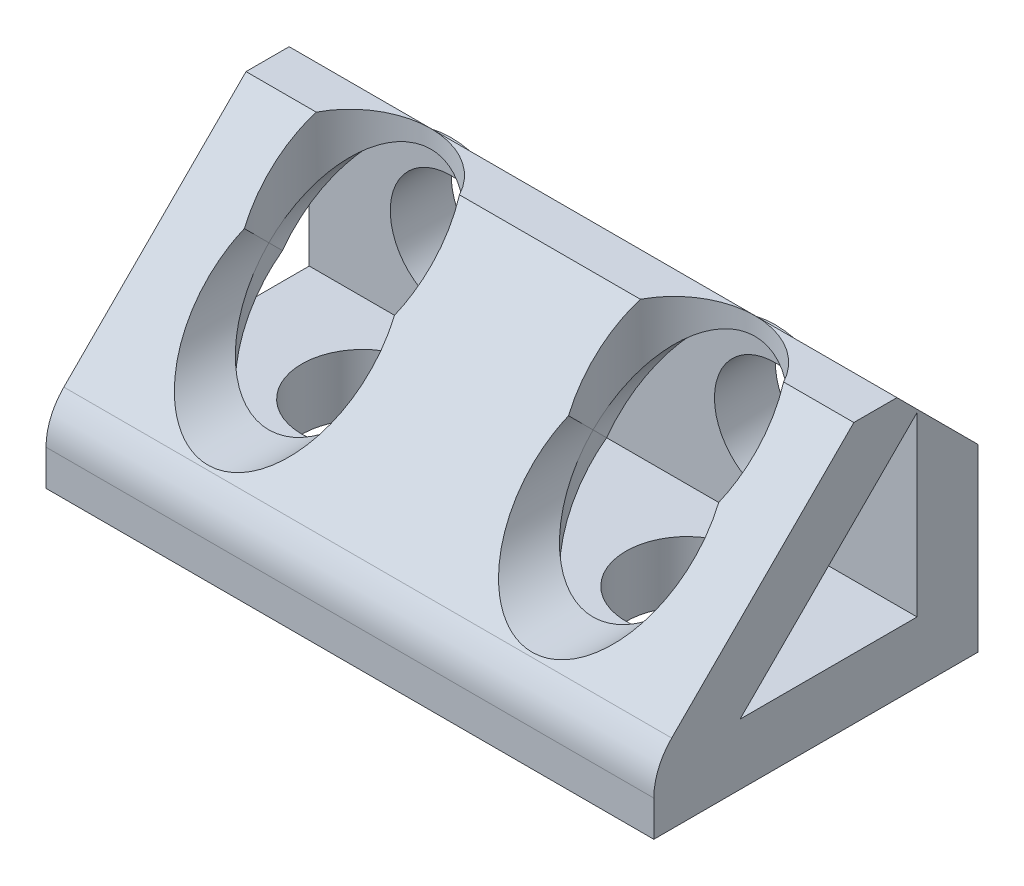
ISO-10303-21;
HEADER;
FILE_DESCRIPTION(('STEP AP214'),'2;1');
FILE_NAME('part.step','',(''),(''),'','','');
FILE_SCHEMA(('AUTOMOTIVE_DESIGN { 1 0 10303 214 1 1 1 1 }'));
ENDSEC;
DATA;
#1=APPLICATION_CONTEXT('core data for automotive mechanical design processes');
#2=APPLICATION_PROTOCOL_DEFINITION('international standard','automotive_design',2000,#1);
#3=PRODUCT_CONTEXT('',#1,'mechanical');
#4=PRODUCT('Part','Part','',(#3));
#5=PRODUCT_RELATED_PRODUCT_CATEGORY('part','',(#4));
#6=PRODUCT_DEFINITION_FORMATION('','',#4);
#7=PRODUCT_DEFINITION_CONTEXT('part definition',#1,'design');
#8=PRODUCT_DEFINITION('design','',#6,#7);
#9=PRODUCT_DEFINITION_SHAPE('','',#8);
#10=(LENGTH_UNIT() NAMED_UNIT(*) SI_UNIT(.MILLI.,.METRE.));
#11=(NAMED_UNIT(*) PLANE_ANGLE_UNIT() SI_UNIT($,.RADIAN.));
#12=(NAMED_UNIT(*) SI_UNIT($,.STERADIAN.) SOLID_ANGLE_UNIT());
#13=UNCERTAINTY_MEASURE_WITH_UNIT(LENGTH_MEASURE(1.E-05),#10,'distance_accuracy_value','');
#14=(GEOMETRIC_REPRESENTATION_CONTEXT(3) GLOBAL_UNCERTAINTY_ASSIGNED_CONTEXT((#13)) GLOBAL_UNIT_ASSIGNED_CONTEXT((#10,
#11,#12)) REPRESENTATION_CONTEXT('',''));
#15=CARTESIAN_POINT('',(0.,0.,0.));
#16=DIRECTION('',(0.,0.,1.));
#17=DIRECTION('',(1.,0.,0.));
#18=AXIS2_PLACEMENT_3D('',#15,#16,#17);
#19=CARTESIAN_POINT('',(-23.81255,20.447,0.));
#20=DIRECTION('',(0.,-1.,0.));
#21=DIRECTION('',(0.,0.,-1.));
#22=AXIS2_PLACEMENT_3D('',#19,#20,#21);
#23=PLANE('',#22);
#24=DIRECTION('',(0.,0.,-1.));
#25=VECTOR('',#24,1.);
#26=CARTESIAN_POINT('',(23.8125,20.447,0.));
#27=LINE('',#26,#25);
#28=CARTESIAN_POINT('',(23.8125,20.447,9.7282));
#29=VERTEX_POINT('',#28);
#30=CARTESIAN_POINT('',(23.8125,20.447,6.35000000000002));
#31=VERTEX_POINT('',#30);
#32=EDGE_CURVE('E274',#29,#31,#27,.T.);
#33=ORIENTED_EDGE('',*,*,#32,.T.);
#34=DIRECTION('',(-1.,0.,0.));
#35=VECTOR('',#34,1.);
#36=CARTESIAN_POINT('',(-23.81255,20.447,6.35000000000002));
#37=LINE('',#36,#35);
#38=CARTESIAN_POINT('',(12.7,20.447,6.35000000000002));
#39=VERTEX_POINT('',#38);
#40=EDGE_CURVE('E242',#31,#39,#37,.T.);
#41=ORIENTED_EDGE('',*,*,#40,.T.);
#42=CARTESIAN_POINT('',(12.7,20.447,12.7));
#43=DIRECTION('',(0.,-1.,0.));
#44=DIRECTION('',(0.,0.,-1.));
#45=AXIS2_PLACEMENT_3D('',#42,#43,#44);
#46=CIRCLE('',#45,6.35);
#47=CARTESIAN_POINT('',(18.3116757532844,20.447,9.7282));
#48=VERTEX_POINT('',#47);
#49=EDGE_CURVE('E292',#48,#39,#46,.F.);
#50=ORIENTED_EDGE('',*,*,#49,.F.);
#51=DIRECTION('',(-1.,0.,0.));
#52=VECTOR('',#51,1.);
#53=CARTESIAN_POINT('',(23.8125,20.447,9.7282));
#54=LINE('',#53,#52);
#55=EDGE_CURVE('E289',#29,#48,#54,.T.);
#56=ORIENTED_EDGE('',*,*,#55,.F.);
#57=EDGE_LOOP('',(#33,#41,#50,#56));
#58=FACE_BOUND('',#57,.T.);
#59=ADVANCED_FACE('F42',(#58),#23,.F.);
#60=CARTESIAN_POINT('',(7.08832424671561,20.447,9.7282));
#61=VERTEX_POINT('',#60);
#62=EDGE_CURVE('E291',#39,#61,#46,.F.);
#63=ORIENTED_EDGE('',*,*,#62,.F.);
#64=DIRECTION('',(-1.,0.,0.));
#65=VECTOR('',#64,1.);
#66=CARTESIAN_POINT('',(-23.81255,20.447,6.35000000000002));
#67=LINE('',#66,#65);
#68=CARTESIAN_POINT('',(-12.7,20.447,6.35000000000002));
#69=VERTEX_POINT('',#68);
#70=EDGE_CURVE('E238',#39,#69,#67,.T.);
#71=ORIENTED_EDGE('',*,*,#70,.T.);
#72=CARTESIAN_POINT('',(-12.7,20.447,12.7));
#73=DIRECTION('',(0.,-1.,0.));
#74=DIRECTION('',(0.,0.,-1.));
#75=AXIS2_PLACEMENT_3D('',#72,#73,#74);
#76=CIRCLE('',#75,6.35);
#77=CARTESIAN_POINT('',(-7.0883242467156,20.447,9.7282));
#78=VERTEX_POINT('',#77);
#79=EDGE_CURVE('E282',#78,#69,#76,.F.);
#80=ORIENTED_EDGE('',*,*,#79,.F.);
#81=EDGE_CURVE('E288',#61,#78,#54,.T.);
#82=ORIENTED_EDGE('',*,*,#81,.F.);
#83=EDGE_LOOP('',(#63,#71,#80,#82));
#84=FACE_BOUND('',#83,.T.);
#85=ADVANCED_FACE('F916',(#84),#23,.F.);
#86=CARTESIAN_POINT('',(-12.7,4.7752,12.7));
#87=DIRECTION('',(0.,-1.,0.));
#88=DIRECTION('',(0.,0.,-1.));
#89=AXIS2_PLACEMENT_3D('',#86,#87,#88);
#90=CYLINDRICAL_SURFACE('',#89,6.35);
#91=CARTESIAN_POINT('',(-12.7,10.722047396956,12.7));
#92=DIRECTION('',(0.,-0.707106781186548,-0.707106781186548));
#93=DIRECTION('',(0.,0.707106781186548,-0.707106781186548));
#94=AXIS2_PLACEMENT_3D('',#91,#92,#93);
#95=ELLIPSE('',#94,8.98025612106916,6.35);
#96=CARTESIAN_POINT('',(-14.9265457635804,4.7752,18.646847396956));
#97=VERTEX_POINT('',#96);
#98=CARTESIAN_POINT('',(-18.9725135213109,11.711023698478,11.711023698478));
#99=VERTEX_POINT('',#98);
#100=EDGE_CURVE('E673',#97,#99,#95,.T.);
#101=ORIENTED_EDGE('',*,*,#100,.T.);
#102=CARTESIAN_POINT('',(-12.7,12.7,12.7));
#103=DIRECTION('',(0.,0.707106781186548,-0.707106781186548));
#104=DIRECTION('',(0.,0.707106781186548,0.707106781186548));
#105=AXIS2_PLACEMENT_3D('',#102,#103,#104);
#106=ELLIPSE('',#105,8.98025612106916,6.35);
#107=CARTESIAN_POINT('',(-19.05,12.7,12.7));
#108=VERTEX_POINT('',#107);
#109=EDGE_CURVE('E398',#99,#108,#106,.T.);
#110=ORIENTED_EDGE('',*,*,#109,.T.);
#111=CARTESIAN_POINT('',(-12.7,12.7,12.7));
#112=DIRECTION('',(0.,0.707106781186548,0.707106781186548));
#113=DIRECTION('',(0.,0.707106781186548,-0.707106781186548));
#114=AXIS2_PLACEMENT_3D('',#111,#112,#113);
#115=ELLIPSE('',#114,8.98025612106916,6.35);
#116=CARTESIAN_POINT('',(-6.35,12.7,12.7));
#117=VERTEX_POINT('',#116);
#118=EDGE_CURVE('E396',#108,#117,#115,.T.);
#119=ORIENTED_EDGE('',*,*,#118,.T.);
#120=CARTESIAN_POINT('',(-12.7,12.7,12.7));
#121=DIRECTION('',(0.,0.707106781186548,-0.707106781186548));
#122=DIRECTION('',(0.,0.707106781186548,0.707106781186548));
#123=AXIS2_PLACEMENT_3D('',#120,#121,#122);
#124=ELLIPSE('',#123,8.98025612106916,6.35);
#125=CARTESIAN_POINT('',(-6.42748647868912,11.711023698478,11.711023698478));
#126=VERTEX_POINT('',#125);
#127=EDGE_CURVE('E411',#117,#126,#124,.T.);
#128=ORIENTED_EDGE('',*,*,#127,.T.);
#129=CARTESIAN_POINT('',(-12.7,10.722047396956,12.7));
#130=DIRECTION('',(0.,-0.707106781186548,-0.707106781186548));
#131=DIRECTION('',(0.,0.707106781186548,-0.707106781186548));
#132=AXIS2_PLACEMENT_3D('',#129,#130,#131);
#133=ELLIPSE('',#132,8.98025612106916,6.35);
#134=CARTESIAN_POINT('',(-10.4734542364196,4.7752,18.646847396956));
#135=VERTEX_POINT('',#134);
#136=EDGE_CURVE('E414',#126,#135,#133,.T.);
#137=ORIENTED_EDGE('',*,*,#136,.T.);
#138=CARTESIAN_POINT('',(-12.7,4.7752,12.7));
#139=DIRECTION('',(0.,1.,0.));
#140=DIRECTION('',(1.,0.,0.));
#141=AXIS2_PLACEMENT_3D('',#138,#139,#140);
#142=CIRCLE('',#141,6.35);
#143=EDGE_CURVE('E430',#97,#135,#142,.T.);
#144=ORIENTED_EDGE('',*,*,#143,.F.);
#145=EDGE_LOOP('',(#101,#110,#119,#128,#137,#144));
#146=FACE_BOUND('',#145,.T.);
#147=ADVANCED_FACE('F700',(#146),#90,.F.);
#148=CARTESIAN_POINT('',(23.8125,24.001376301522,6.173823698478));
#149=DIRECTION('',(0.,-0.707106781186548,-0.707106781186548));
#150=DIRECTION('',(0.,0.707106781186548,-0.707106781186548));
#151=AXIS2_PLACEMENT_3D('',#148,#149,#150);
#152=PLANE('',#151);
#153=DIRECTION('',(0.,-0.707106781186548,0.707106781186548));
#154=VECTOR('',#153,1.);
#155=CARTESIAN_POINT('',(23.8125,24.001376301522,6.173823698478));
#156=LINE('',#155,#154);
#157=CARTESIAN_POINT('',(23.8125,6.17382369847761,24.0013763015224));
#158=VERTEX_POINT('',#157);
#159=EDGE_CURVE('E816',#29,#158,#156,.T.);
#160=ORIENTED_EDGE('',*,*,#159,.F.);
#161=ORIENTED_EDGE('',*,*,#55,.T.);
#162=CARTESIAN_POINT('',(12.7,17.4752,12.7));
#163=DIRECTION('',(0.,-0.707106781186548,-0.707106781186548));
#164=DIRECTION('',(0.,0.707106781186548,-0.707106781186548));
#165=AXIS2_PLACEMENT_3D('',#162,#163,#164);
#166=ELLIPSE('',#165,8.98025612106916,6.35);
#167=CARTESIAN_POINT('',(18.5840348605357,15.0876,15.0876));
#168=VERTEX_POINT('',#167);
#169=EDGE_CURVE('E878',#48,#168,#166,.T.);
#170=ORIENTED_EDGE('',*,*,#169,.T.);
#171=CARTESIAN_POINT('',(12.7,12.7,17.4752));
#172=DIRECTION('',(0.,-0.707106781186548,-0.707106781186548));
#173=DIRECTION('',(0.,-0.707106781186548,0.707106781186548));
#174=AXIS2_PLACEMENT_3D('',#171,#172,#173);
#175=ELLIPSE('',#174,8.98025612106916,6.35);
#176=CARTESIAN_POINT('',(6.81596513946425,15.0876,15.0876));
#177=VERTEX_POINT('',#176);
#178=EDGE_CURVE('E365',#168,#177,#175,.T.);
#179=ORIENTED_EDGE('',*,*,#178,.T.);
#180=EDGE_CURVE('E363',#177,#61,#166,.T.);
#181=ORIENTED_EDGE('',*,*,#180,.T.);
#182=ORIENTED_EDGE('',*,*,#81,.T.);
#183=CARTESIAN_POINT('',(-12.7,17.4752,12.7));
#184=DIRECTION('',(0.,-0.707106781186548,-0.707106781186548));
#185=DIRECTION('',(0.,0.707106781186548,-0.707106781186548));
#186=AXIS2_PLACEMENT_3D('',#183,#184,#185);
#187=ELLIPSE('',#186,8.98025612106916,6.35);
#188=CARTESIAN_POINT('',(-6.81596513946425,15.0876,15.0876));
#189=VERTEX_POINT('',#188);
#190=EDGE_CURVE('E656',#78,#189,#187,.T.);
#191=ORIENTED_EDGE('',*,*,#190,.T.);
#192=CARTESIAN_POINT('',(-12.7,12.7,17.4752));
#193=DIRECTION('',(0.,-0.707106781186548,-0.707106781186548));
#194=DIRECTION('',(0.,-0.707106781186548,0.707106781186548));
#195=AXIS2_PLACEMENT_3D('',#192,#193,#194);
#196=ELLIPSE('',#195,8.98025612106916,6.35);
#197=CARTESIAN_POINT('',(-18.5840348605357,15.0876,15.0876));
#198=VERTEX_POINT('',#197);
#199=EDGE_CURVE('E346',#189,#198,#196,.T.);
#200=ORIENTED_EDGE('',*,*,#199,.T.);
#201=CARTESIAN_POINT('',(-18.3116757532844,20.447,9.7282));
#202=VERTEX_POINT('',#201);
#203=EDGE_CURVE('E348',#198,#202,#187,.T.);
#204=ORIENTED_EDGE('',*,*,#203,.T.);
#205=CARTESIAN_POINT('',(-23.8125,20.447,9.7282));
#206=VERTEX_POINT('',#205);
#207=EDGE_CURVE('E285',#202,#206,#54,.T.);
#208=ORIENTED_EDGE('',*,*,#207,.T.);
#209=DIRECTION('',(0.,-0.707106781186548,0.707106781186548));
#210=VECTOR('',#209,1.);
#211=CARTESIAN_POINT('',(-23.8125,24.001376301522,6.173823698478));
#212=LINE('',#211,#210);
#213=CARTESIAN_POINT('',(-23.8125,6.17382369847761,24.0013763015224));
#214=VERTEX_POINT('',#213);
#215=EDGE_CURVE('E557',#206,#214,#212,.T.);
#216=ORIENTED_EDGE('',*,*,#215,.T.);
#217=DIRECTION('',(-1.,0.,0.));
#218=VECTOR('',#217,1.);
#219=CARTESIAN_POINT('',(23.8125,6.17382369847762,24.0013763015224));
#220=LINE('',#219,#218);
#221=EDGE_CURVE('E670',#214,#158,#220,.F.);
#222=ORIENTED_EDGE('',*,*,#221,.T.);
#223=EDGE_LOOP('',(#160,#161,#170,#179,#181,#182,#191,#200,#204,#208,#216,#222));
#224=FACE_BOUND('',#223,.T.);
#225=ADVANCED_FACE('F892',(#224),#152,.F.);
#226=CARTESIAN_POINT('',(23.8125,2.79724739695653,20.6248000000013));
#227=DIRECTION('',(1.,0.,0.));
#228=DIRECTION('',(0.,0.,-1.));
#229=AXIS2_PLACEMENT_3D('',#226,#227,#228);
#230=PLANE('',#229);
#231=DIRECTION('',(0.,-1.,0.));
#232=VECTOR('',#231,1.);
#233=CARTESIAN_POINT('',(23.8125,0.,0.));
#234=LINE('',#233,#232);
#235=CARTESIAN_POINT('',(23.8125,14.097,0.));
#236=VERTEX_POINT('',#235);
#237=CARTESIAN_POINT('',(23.8125,0.,0.));
#238=VERTEX_POINT('',#237);
#239=EDGE_CURVE('E295',#236,#238,#234,.T.);
#240=ORIENTED_EDGE('',*,*,#239,.F.);
#241=DIRECTION('',(0.,-0.707106781186546,-0.707106781186549));
#242=VECTOR('',#241,1.);
#243=CARTESIAN_POINT('',(23.8125,18.7595236984789,4.66252369847894));
#244=LINE('',#243,#242);
#245=EDGE_CURVE('E222',#236,#31,#244,.F.);
#246=ORIENTED_EDGE('',*,*,#245,.T.);
#247=ORIENTED_EDGE('',*,*,#32,.F.);
#248=ORIENTED_EDGE('',*,*,#159,.T.);
#249=CARTESIAN_POINT('',(23.8125,2.79724739695653,20.6248000000013));
#250=DIRECTION('',(1.,0.,0.));
#251=DIRECTION('',(0.,0.,-1.));
#252=AXIS2_PLACEMENT_3D('',#249,#250,#251);
#253=CIRCLE('',#252,4.7751999999987);
#254=CARTESIAN_POINT('',(23.8125,2.79724739695653,25.4));
#255=VERTEX_POINT('',#254);
#256=EDGE_CURVE('E228',#158,#255,#253,.T.);
#257=ORIENTED_EDGE('',*,*,#256,.T.);
#258=DIRECTION('',(0.,1.,0.));
#259=VECTOR('',#258,1.);
#260=CARTESIAN_POINT('',(23.8125,0.,25.4));
#261=LINE('',#260,#259);
#262=CARTESIAN_POINT('',(23.8125,0.,25.4));
#263=VERTEX_POINT('',#262);
#264=EDGE_CURVE('E330',#263,#255,#261,.T.);
#265=ORIENTED_EDGE('',*,*,#264,.F.);
#266=DIRECTION('',(0.,0.,1.));
#267=VECTOR('',#266,1.);
#268=CARTESIAN_POINT('',(23.8125,0.,25.4));
#269=LINE('',#268,#267);
#270=EDGE_CURVE('E307',#238,#263,#269,.T.);
#271=ORIENTED_EDGE('',*,*,#270,.F.);
#272=EDGE_LOOP('',(#240,#246,#247,#248,#257,#265,#271));
#273=FACE_BOUND('',#272,.T.);
#274=DIRECTION('',(0.,-0.707106781186548,0.707106781186548));
#275=VECTOR('',#274,1.);
#276=CARTESIAN_POINT('',(23.8125,18.646847396956,4.7752));
#277=LINE('',#276,#275);
#278=CARTESIAN_POINT('',(23.8125,18.646847396956,4.7752));
#279=VERTEX_POINT('',#278);
#280=CARTESIAN_POINT('',(23.8125,4.7752,18.646847396956));
#281=VERTEX_POINT('',#280);
#282=EDGE_CURVE('E742',#279,#281,#277,.T.);
#283=ORIENTED_EDGE('',*,*,#282,.F.);
#284=DIRECTION('',(0.,-1.,0.));
#285=VECTOR('',#284,1.);
#286=CARTESIAN_POINT('',(23.8125,0.,4.7752));
#287=LINE('',#286,#285);
#288=CARTESIAN_POINT('',(23.8125,4.7752,4.7752));
#289=VERTEX_POINT('',#288);
#290=EDGE_CURVE('E304',#279,#289,#287,.T.);
#291=ORIENTED_EDGE('',*,*,#290,.T.);
#292=DIRECTION('',(0.,0.,1.));
#293=VECTOR('',#292,1.);
#294=CARTESIAN_POINT('',(23.8125,4.7752,25.4));
#295=LINE('',#294,#293);
#296=EDGE_CURVE('E317',#289,#281,#295,.T.);
#297=ORIENTED_EDGE('',*,*,#296,.T.);
#298=EDGE_LOOP('',(#283,#291,#297));
#299=FACE_BOUND('',#298,.T.);
#300=ADVANCED_FACE('F812',(#273,#299),#230,.T.);
#301=CARTESIAN_POINT('',(12.7,12.7,4.7752));
#302=DIRECTION('',(0.,0.,-1.));
#303=DIRECTION('',(0.,-1.,0.));
#304=AXIS2_PLACEMENT_3D('',#301,#302,#303);
#305=CYLINDRICAL_SURFACE('',#304,6.35);
#306=CARTESIAN_POINT('',(12.7,12.7,10.722047396956));
#307=DIRECTION('',(0.,-0.707106781186548,-0.707106781186548));
#308=DIRECTION('',(0.,-0.707106781186548,0.707106781186548));
#309=AXIS2_PLACEMENT_3D('',#306,#307,#308);
#310=ELLIPSE('',#309,8.98025612106916,6.35);
#311=CARTESIAN_POINT('',(14.9265457635804,18.646847396956,4.7752));
#312=VERTEX_POINT('',#311);
#313=CARTESIAN_POINT('',(18.9725135213109,11.711023698478,11.711023698478));
#314=VERTEX_POINT('',#313);
#315=EDGE_CURVE('E469',#312,#314,#310,.T.);
#316=ORIENTED_EDGE('',*,*,#315,.T.);
#317=CARTESIAN_POINT('',(12.7,12.7,12.7));
#318=DIRECTION('',(0.,-0.707106781186548,0.707106781186548));
#319=DIRECTION('',(0.,0.707106781186548,0.707106781186548));
#320=AXIS2_PLACEMENT_3D('',#317,#318,#319);
#321=ELLIPSE('',#320,8.98025612106916,6.35);
#322=CARTESIAN_POINT('',(19.05,12.7,12.7));
#323=VERTEX_POINT('',#322);
#324=EDGE_CURVE('E484',#314,#323,#321,.T.);
#325=ORIENTED_EDGE('',*,*,#324,.T.);
#326=CARTESIAN_POINT('',(12.7,12.7,12.7));
#327=DIRECTION('',(0.,0.707106781186548,0.707106781186548));
#328=DIRECTION('',(0.,-0.707106781186548,0.707106781186548));
#329=AXIS2_PLACEMENT_3D('',#326,#327,#328);
#330=ELLIPSE('',#329,8.98025612106916,6.35);
#331=CARTESIAN_POINT('',(6.35,12.7,12.7));
#332=VERTEX_POINT('',#331);
#333=EDGE_CURVE('E487',#323,#332,#330,.T.);
#334=ORIENTED_EDGE('',*,*,#333,.T.);
#335=CARTESIAN_POINT('',(12.7,12.7,12.7));
#336=DIRECTION('',(0.,-0.707106781186548,0.707106781186548));
#337=DIRECTION('',(0.,0.707106781186548,0.707106781186548));
#338=AXIS2_PLACEMENT_3D('',#335,#336,#337);
#339=ELLIPSE('',#338,8.98025612106916,6.35);
#340=CARTESIAN_POINT('',(6.42748647868912,11.711023698478,11.711023698478));
#341=VERTEX_POINT('',#340);
#342=EDGE_CURVE('E718',#332,#341,#339,.T.);
#343=ORIENTED_EDGE('',*,*,#342,.T.);
#344=CARTESIAN_POINT('',(12.7,12.7,10.722047396956));
#345=DIRECTION('',(0.,-0.707106781186548,-0.707106781186548));
#346=DIRECTION('',(0.,-0.707106781186548,0.707106781186548));
#347=AXIS2_PLACEMENT_3D('',#344,#345,#346);
#348=ELLIPSE('',#347,8.98025612106916,6.35);
#349=CARTESIAN_POINT('',(10.4734542364196,18.646847396956,4.7752));
#350=VERTEX_POINT('',#349);
#351=EDGE_CURVE('E710',#341,#350,#348,.T.);
#352=ORIENTED_EDGE('',*,*,#351,.T.);
#353=CARTESIAN_POINT('',(12.7,12.7,4.7752));
#354=DIRECTION('',(0.,0.,1.));
#355=DIRECTION('',(1.,0.,0.));
#356=AXIS2_PLACEMENT_3D('',#353,#354,#355);
#357=CIRCLE('',#356,6.35);
#358=EDGE_CURVE('E471',#312,#350,#357,.T.);
#359=ORIENTED_EDGE('',*,*,#358,.F.);
#360=EDGE_LOOP('',(#316,#325,#334,#343,#352,#359));
#361=FACE_BOUND('',#360,.T.);
#362=ADVANCED_FACE('F819',(#361),#305,.F.);
#363=CARTESIAN_POINT('',(23.8125,18.646847396956,4.7752));
#364=DIRECTION('',(0.,-0.707106781186548,-0.707106781186548));
#365=DIRECTION('',(0.,0.707106781186548,-0.707106781186548));
#366=AXIS2_PLACEMENT_3D('',#363,#364,#365);
#367=PLANE('',#366);
#368=CARTESIAN_POINT('',(-12.7,12.7,10.722047396956));
#369=DIRECTION('',(0.,-0.707106781186548,-0.707106781186548));
#370=DIRECTION('',(0.,-0.707106781186548,0.707106781186548));
#371=AXIS2_PLACEMENT_3D('',#368,#369,#370);
#372=ELLIPSE('',#371,8.98025612106916,6.35);
#373=CARTESIAN_POINT('',(-10.4734542364196,18.646847396956,4.7752));
#374=VERTEX_POINT('',#373);
#375=EDGE_CURVE('E705',#374,#126,#372,.T.);
#376=ORIENTED_EDGE('',*,*,#375,.F.);
#377=DIRECTION('',(-1.,0.,0.));
#378=VECTOR('',#377,1.);
#379=CARTESIAN_POINT('',(23.8125,18.646847396956,4.7752));
#380=LINE('',#379,#378);
#381=EDGE_CURVE('E737',#350,#374,#380,.T.);
#382=ORIENTED_EDGE('',*,*,#381,.F.);
#383=ORIENTED_EDGE('',*,*,#351,.F.);
#384=CARTESIAN_POINT('',(12.7,10.722047396956,12.7));
#385=DIRECTION('',(0.,-0.707106781186548,-0.707106781186548));
#386=DIRECTION('',(0.,0.707106781186548,-0.707106781186548));
#387=AXIS2_PLACEMENT_3D('',#384,#385,#386);
#388=ELLIPSE('',#387,8.98025612106916,6.35);
#389=CARTESIAN_POINT('',(10.4734542364196,4.7752,18.646847396956));
#390=VERTEX_POINT('',#389);
#391=EDGE_CURVE('E711',#390,#341,#388,.T.);
#392=ORIENTED_EDGE('',*,*,#391,.F.);
#393=DIRECTION('',(-1.,0.,0.));
#394=VECTOR('',#393,1.);
#395=CARTESIAN_POINT('',(23.8125,4.7752,18.646847396956));
#396=LINE('',#395,#394);
#397=EDGE_CURVE('E518',#390,#135,#396,.T.);
#398=ORIENTED_EDGE('',*,*,#397,.T.);
#399=ORIENTED_EDGE('',*,*,#136,.F.);
#400=EDGE_LOOP('',(#376,#382,#383,#392,#398,#399));
#401=FACE_BOUND('',#400,.T.);
#402=ADVANCED_FACE('F779',(#401),#367,.T.);
#403=CARTESIAN_POINT('',(12.7,4.7752,12.7));
#404=DIRECTION('',(0.,-1.,0.));
#405=DIRECTION('',(0.,0.,-1.));
#406=AXIS2_PLACEMENT_3D('',#403,#404,#405);
#407=CYLINDRICAL_SURFACE('',#406,6.35);
#408=CARTESIAN_POINT('',(12.7,12.7,12.7));
#409=DIRECTION('',(0.,0.707106781186548,0.707106781186548));
#410=DIRECTION('',(0.,-0.707106781186548,0.707106781186548));
#411=AXIS2_PLACEMENT_3D('',#408,#409,#410);
#412=ELLIPSE('',#411,8.98025612106916,6.35);
#413=EDGE_CURVE('E505',#332,#323,#412,.T.);
#414=ORIENTED_EDGE('',*,*,#413,.T.);
#415=ORIENTED_EDGE('',*,*,#324,.F.);
#416=CARTESIAN_POINT('',(12.7,10.722047396956,12.7));
#417=DIRECTION('',(0.,-0.707106781186548,-0.707106781186548));
#418=DIRECTION('',(0.,0.707106781186548,-0.707106781186548));
#419=AXIS2_PLACEMENT_3D('',#416,#417,#418);
#420=ELLIPSE('',#419,8.98025612106916,6.35);
#421=CARTESIAN_POINT('',(14.9265457635804,4.7752,18.646847396956));
#422=VERTEX_POINT('',#421);
#423=EDGE_CURVE('E503',#314,#422,#420,.T.);
#424=ORIENTED_EDGE('',*,*,#423,.T.);
#425=CARTESIAN_POINT('',(12.7,4.7752,12.7));
#426=DIRECTION('',(0.,1.,0.));
#427=DIRECTION('',(1.,0.,0.));
#428=AXIS2_PLACEMENT_3D('',#425,#426,#427);
#429=CIRCLE('',#428,6.35);
#430=EDGE_CURVE('E516',#390,#422,#429,.T.);
#431=ORIENTED_EDGE('',*,*,#430,.F.);
#432=ORIENTED_EDGE('',*,*,#391,.T.);
#433=ORIENTED_EDGE('',*,*,#342,.F.);
#434=EDGE_LOOP('',(#414,#415,#424,#431,#432,#433));
#435=FACE_BOUND('',#434,.T.);
#436=ADVANCED_FACE('F785',(#435),#407,.F.);
#437=CARTESIAN_POINT('',(23.8125,18.646847396956,4.7752));
#438=DIRECTION('',(0.,-0.707106781186548,-0.707106781186548));
#439=DIRECTION('',(0.,0.707106781186548,-0.707106781186548));
#440=AXIS2_PLACEMENT_3D('',#437,#438,#439);
#441=PLANE('',#440);
#442=ORIENTED_EDGE('',*,*,#423,.F.);
#443=ORIENTED_EDGE('',*,*,#315,.F.);
#444=DIRECTION('',(-1.,0.,0.));
#445=VECTOR('',#444,1.);
#446=CARTESIAN_POINT('',(23.8125,18.646847396956,4.7752));
#447=LINE('',#446,#445);
#448=EDGE_CURVE('E756',#279,#312,#447,.T.);
#449=ORIENTED_EDGE('',*,*,#448,.F.);
#450=ORIENTED_EDGE('',*,*,#282,.T.);
#451=DIRECTION('',(-1.,0.,0.));
#452=VECTOR('',#451,1.);
#453=CARTESIAN_POINT('',(23.8125,4.7752,18.646847396956));
#454=LINE('',#453,#452);
#455=EDGE_CURVE('E533',#281,#422,#454,.T.);
#456=ORIENTED_EDGE('',*,*,#455,.T.);
#457=EDGE_LOOP('',(#442,#443,#449,#450,#456));
#458=FACE_BOUND('',#457,.T.);
#459=ADVANCED_FACE('F818',(#458),#441,.T.);
#460=CARTESIAN_POINT('',(12.7,12.7,4.7752));
#461=DIRECTION('',(0.,0.,-1.));
#462=DIRECTION('',(0.,1.,0.));
#463=AXIS2_PLACEMENT_3D('',#460,#461,#462);
#464=CYLINDRICAL_SURFACE('',#463,6.35);
#465=ORIENTED_EDGE('',*,*,#178,.F.);
#466=CARTESIAN_POINT('',(12.7,12.7,12.7));
#467=DIRECTION('',(0.,-0.707106781186548,0.707106781186548));
#468=DIRECTION('',(0.,0.707106781186548,0.707106781186548));
#469=AXIS2_PLACEMENT_3D('',#466,#467,#468);
#470=ELLIPSE('',#469,8.98025612106916,6.35);
#471=EDGE_CURVE('E853',#323,#168,#470,.T.);
#472=ORIENTED_EDGE('',*,*,#471,.F.);
#473=ORIENTED_EDGE('',*,*,#413,.F.);
#474=CARTESIAN_POINT('',(12.7,12.7,12.7));
#475=DIRECTION('',(0.,-0.707106781186548,0.707106781186548));
#476=DIRECTION('',(0.,0.707106781186548,0.707106781186548));
#477=AXIS2_PLACEMENT_3D('',#474,#475,#476);
#478=ELLIPSE('',#477,8.98025612106916,6.35);
#479=EDGE_CURVE('E382',#177,#332,#478,.T.);
#480=ORIENTED_EDGE('',*,*,#479,.F.);
#481=EDGE_LOOP('',(#465,#472,#473,#480));
#482=FACE_BOUND('',#481,.T.);
#483=ADVANCED_FACE('F1011',(#482),#464,.F.);
#484=CARTESIAN_POINT('',(12.7,4.7752,12.7));
#485=DIRECTION('',(0.,-1.,0.));
#486=DIRECTION('',(0.,0.,1.));
#487=AXIS2_PLACEMENT_3D('',#484,#485,#486);
#488=CYLINDRICAL_SURFACE('',#487,6.35);
#489=ORIENTED_EDGE('',*,*,#169,.F.);
#490=ORIENTED_EDGE('',*,*,#49,.T.);
#491=ORIENTED_EDGE('',*,*,#62,.T.);
#492=ORIENTED_EDGE('',*,*,#180,.F.);
#493=ORIENTED_EDGE('',*,*,#479,.T.);
#494=ORIENTED_EDGE('',*,*,#333,.F.);
#495=ORIENTED_EDGE('',*,*,#471,.T.);
#496=EDGE_LOOP('',(#489,#490,#491,#492,#493,#494,#495));
#497=FACE_BOUND('',#496,.T.);
#498=ADVANCED_FACE('F940',(#497),#488,.F.);
#499=CARTESIAN_POINT('',(-12.7,12.7,4.7752));
#500=DIRECTION('',(0.,0.,-1.));
#501=DIRECTION('',(0.,-1.,0.));
#502=AXIS2_PLACEMENT_3D('',#499,#500,#501);
#503=CYLINDRICAL_SURFACE('',#502,6.35);
#504=CARTESIAN_POINT('',(-12.7,12.7,12.7));
#505=DIRECTION('',(0.,0.707106781186548,0.707106781186548));
#506=DIRECTION('',(0.,0.707106781186548,-0.707106781186548));
#507=AXIS2_PLACEMENT_3D('',#504,#505,#506);
#508=ELLIPSE('',#507,8.98025612106916,6.35);
#509=EDGE_CURVE('E381',#117,#108,#508,.T.);
#510=ORIENTED_EDGE('',*,*,#509,.T.);
#511=ORIENTED_EDGE('',*,*,#109,.F.);
#512=CARTESIAN_POINT('',(-12.7,12.7,10.722047396956));
#513=DIRECTION('',(0.,-0.707106781186548,-0.707106781186548));
#514=DIRECTION('',(0.,-0.707106781186548,0.707106781186548));
#515=AXIS2_PLACEMENT_3D('',#512,#513,#514);
#516=ELLIPSE('',#515,8.98025612106916,6.35);
#517=CARTESIAN_POINT('',(-14.9265457635804,18.646847396956,4.7752));
#518=VERTEX_POINT('',#517);
#519=EDGE_CURVE('E613',#99,#518,#516,.T.);
#520=ORIENTED_EDGE('',*,*,#519,.T.);
#521=CARTESIAN_POINT('',(-12.7,12.7,4.7752));
#522=DIRECTION('',(0.,0.,1.));
#523=DIRECTION('',(1.,0.,0.));
#524=AXIS2_PLACEMENT_3D('',#521,#522,#523);
#525=CIRCLE('',#524,6.35);
#526=EDGE_CURVE('E706',#374,#518,#525,.T.);
#527=ORIENTED_EDGE('',*,*,#526,.F.);
#528=ORIENTED_EDGE('',*,*,#375,.T.);
#529=ORIENTED_EDGE('',*,*,#127,.F.);
#530=EDGE_LOOP('',(#510,#511,#520,#527,#528,#529));
#531=FACE_BOUND('',#530,.T.);
#532=ADVANCED_FACE('F703',(#531),#503,.F.);
#533=CARTESIAN_POINT('',(23.8125,18.646847396956,4.7752));
#534=DIRECTION('',(0.,-0.707106781186548,-0.707106781186548));
#535=DIRECTION('',(0.,0.707106781186548,-0.707106781186548));
#536=AXIS2_PLACEMENT_3D('',#533,#534,#535);
#537=PLANE('',#536);
#538=ORIENTED_EDGE('',*,*,#519,.F.);
#539=ORIENTED_EDGE('',*,*,#100,.F.);
#540=DIRECTION('',(-1.,0.,0.));
#541=VECTOR('',#540,1.);
#542=CARTESIAN_POINT('',(23.8125,4.7752,18.646847396956));
#543=LINE('',#542,#541);
#544=CARTESIAN_POINT('',(-23.8125,4.7752,18.646847396956));
#545=VERTEX_POINT('',#544);
#546=EDGE_CURVE('E440',#97,#545,#543,.T.);
#547=ORIENTED_EDGE('',*,*,#546,.T.);
#548=DIRECTION('',(0.,-0.707106781186548,0.707106781186548));
#549=VECTOR('',#548,1.);
#550=CARTESIAN_POINT('',(-23.8125,18.646847396956,4.7752));
#551=LINE('',#550,#549);
#552=CARTESIAN_POINT('',(-23.8125,18.646847396956,4.7752));
#553=VERTEX_POINT('',#552);
#554=EDGE_CURVE('E612',#553,#545,#551,.T.);
#555=ORIENTED_EDGE('',*,*,#554,.F.);
#556=DIRECTION('',(-1.,0.,0.));
#557=VECTOR('',#556,1.);
#558=CARTESIAN_POINT('',(23.8125,18.646847396956,4.7752));
#559=LINE('',#558,#557);
#560=EDGE_CURVE('E761',#518,#553,#559,.T.);
#561=ORIENTED_EDGE('',*,*,#560,.F.);
#562=EDGE_LOOP('',(#538,#539,#547,#555,#561));
#563=FACE_BOUND('',#562,.T.);
#564=ADVANCED_FACE('F808',(#563),#537,.T.);
#565=CARTESIAN_POINT('',(-23.8125,2.79724739695653,20.6248000000013));
#566=DIRECTION('',(1.,0.,0.));
#567=DIRECTION('',(0.,0.,-1.));
#568=AXIS2_PLACEMENT_3D('',#565,#566,#567);
#569=PLANE('',#568);
#570=DIRECTION('',(0.,1.,0.));
#571=VECTOR('',#570,1.);
#572=CARTESIAN_POINT('',(-23.8125,25.4,4.7752));
#573=LINE('',#572,#571);
#574=CARTESIAN_POINT('',(-23.8125,4.7752,4.7752));
#575=VERTEX_POINT('',#574);
#576=EDGE_CURVE('E297',#575,#553,#573,.T.);
#577=ORIENTED_EDGE('',*,*,#576,.T.);
#578=ORIENTED_EDGE('',*,*,#554,.T.);
#579=DIRECTION('',(0.,0.,-1.));
#580=VECTOR('',#579,1.);
#581=CARTESIAN_POINT('',(-23.8125,4.7752,4.7752));
#582=LINE('',#581,#580);
#583=EDGE_CURVE('E310',#545,#575,#582,.T.);
#584=ORIENTED_EDGE('',*,*,#583,.T.);
#585=EDGE_LOOP('',(#577,#578,#584));
#586=FACE_BOUND('',#585,.T.);
#587=DIRECTION('',(0.,0.,-1.));
#588=VECTOR('',#587,1.);
#589=CARTESIAN_POINT('',(-23.8125,20.447,20.6248000000013));
#590=LINE('',#589,#588);
#591=CARTESIAN_POINT('',(-23.8125,20.447,6.35000000000002));
#592=VERTEX_POINT('',#591);
#593=EDGE_CURVE('E252',#206,#592,#590,.T.);
#594=ORIENTED_EDGE('',*,*,#593,.T.);
#595=DIRECTION('',(0.,0.707106781186546,0.707106781186549));
#596=VECTOR('',#595,1.);
#597=CARTESIAN_POINT('',(-23.8125,14.097,0.));
#598=LINE('',#597,#596);
#599=CARTESIAN_POINT('',(-23.8125,14.097,0.));
#600=VERTEX_POINT('',#599);
#601=EDGE_CURVE('E211',#592,#600,#598,.F.);
#602=ORIENTED_EDGE('',*,*,#601,.T.);
#603=DIRECTION('',(0.,1.,0.));
#604=VECTOR('',#603,1.);
#605=CARTESIAN_POINT('',(-23.8125,25.4,0.));
#606=LINE('',#605,#604);
#607=CARTESIAN_POINT('',(-23.8125,0.,0.));
#608=VERTEX_POINT('',#607);
#609=EDGE_CURVE('E250',#608,#600,#606,.T.);
#610=ORIENTED_EDGE('',*,*,#609,.F.);
#611=DIRECTION('',(0.,0.,-1.));
#612=VECTOR('',#611,1.);
#613=CARTESIAN_POINT('',(-23.8125,0.,4.7752));
#614=LINE('',#613,#612);
#615=CARTESIAN_POINT('',(-23.8125,0.,25.4));
#616=VERTEX_POINT('',#615);
#617=EDGE_CURVE('E312',#616,#608,#614,.T.);
#618=ORIENTED_EDGE('',*,*,#617,.F.);
#619=DIRECTION('',(0.,1.,0.));
#620=VECTOR('',#619,1.);
#621=CARTESIAN_POINT('',(-23.8125,0.,25.4));
#622=LINE('',#621,#620);
#623=CARTESIAN_POINT('',(-23.8125,2.79724739695653,25.4));
#624=VERTEX_POINT('',#623);
#625=EDGE_CURVE('E314',#616,#624,#622,.T.);
#626=ORIENTED_EDGE('',*,*,#625,.T.);
#627=CARTESIAN_POINT('',(-23.8125,2.79724739695653,20.6248000000013));
#628=DIRECTION('',(1.,0.,0.));
#629=DIRECTION('',(0.,0.,-1.));
#630=AXIS2_PLACEMENT_3D('',#627,#628,#629);
#631=CIRCLE('',#630,4.7751999999987);
#632=EDGE_CURVE('E667',#624,#214,#631,.F.);
#633=ORIENTED_EDGE('',*,*,#632,.T.);
#634=ORIENTED_EDGE('',*,*,#215,.F.);
#635=EDGE_LOOP('',(#594,#602,#610,#618,#626,#633,#634));
#636=FACE_BOUND('',#635,.T.);
#637=ADVANCED_FACE('F248',(#586,#636),#569,.F.);
#638=CARTESIAN_POINT('',(-12.7,4.7752,12.7));
#639=DIRECTION('',(0.,-1.,0.));
#640=DIRECTION('',(0.,0.,1.));
#641=AXIS2_PLACEMENT_3D('',#638,#639,#640);
#642=CYLINDRICAL_SURFACE('',#641,6.35);
#643=ORIENTED_EDGE('',*,*,#190,.F.);
#644=ORIENTED_EDGE('',*,*,#79,.T.);
#645=EDGE_CURVE('E281',#69,#202,#76,.F.);
#646=ORIENTED_EDGE('',*,*,#645,.T.);
#647=ORIENTED_EDGE('',*,*,#203,.F.);
#648=CARTESIAN_POINT('',(-12.7,12.7,12.7));
#649=DIRECTION('',(0.,0.707106781186548,-0.707106781186548));
#650=DIRECTION('',(0.,0.707106781186548,0.707106781186548));
#651=AXIS2_PLACEMENT_3D('',#648,#649,#650);
#652=ELLIPSE('',#651,8.98025612106916,6.35);
#653=EDGE_CURVE('E329',#108,#198,#652,.T.);
#654=ORIENTED_EDGE('',*,*,#653,.F.);
#655=ORIENTED_EDGE('',*,*,#509,.F.);
#656=CARTESIAN_POINT('',(-12.7,12.7,12.7));
#657=DIRECTION('',(0.,0.707106781186548,-0.707106781186548));
#658=DIRECTION('',(0.,0.707106781186548,0.707106781186548));
#659=AXIS2_PLACEMENT_3D('',#656,#657,#658);
#660=ELLIPSE('',#659,8.98025612106916,6.35);
#661=EDGE_CURVE('E325',#189,#117,#660,.T.);
#662=ORIENTED_EDGE('',*,*,#661,.F.);
#663=EDGE_LOOP('',(#643,#644,#646,#647,#654,#655,#662));
#664=FACE_BOUND('',#663,.T.);
#665=ADVANCED_FACE('F649',(#664),#642,.F.);
#666=CARTESIAN_POINT('',(-12.7,12.7,4.7752));
#667=DIRECTION('',(0.,0.,-1.));
#668=DIRECTION('',(0.,1.,0.));
#669=AXIS2_PLACEMENT_3D('',#666,#667,#668);
#670=CYLINDRICAL_SURFACE('',#669,6.35);
#671=ORIENTED_EDGE('',*,*,#118,.F.);
#672=ORIENTED_EDGE('',*,*,#653,.T.);
#673=ORIENTED_EDGE('',*,*,#199,.F.);
#674=ORIENTED_EDGE('',*,*,#661,.T.);
#675=EDGE_LOOP('',(#671,#672,#673,#674));
#676=FACE_BOUND('',#675,.T.);
#677=ADVANCED_FACE('F644',(#676),#670,.F.);
#678=CARTESIAN_POINT('',(-23.8125,0.,25.4));
#679=DIRECTION('',(0.,0.,-1.));
#680=DIRECTION('',(-1.,0.,0.));
#681=AXIS2_PLACEMENT_3D('',#678,#679,#680);
#682=PLANE('',#681);
#683=ORIENTED_EDGE('',*,*,#264,.T.);
#684=DIRECTION('',(-1.,0.,0.));
#685=VECTOR('',#684,1.);
#686=CARTESIAN_POINT('',(-23.8125,2.79724739695653,25.4));
#687=LINE('',#686,#685);
#688=EDGE_CURVE('E224',#255,#624,#687,.T.);
#689=ORIENTED_EDGE('',*,*,#688,.T.);
#690=ORIENTED_EDGE('',*,*,#625,.F.);
#691=DIRECTION('',(-1.,0.,0.));
#692=VECTOR('',#691,1.);
#693=CARTESIAN_POINT('',(-23.8125,0.,25.4));
#694=LINE('',#693,#692);
#695=EDGE_CURVE('E309',#263,#616,#694,.T.);
#696=ORIENTED_EDGE('',*,*,#695,.F.);
#697=EDGE_LOOP('',(#683,#689,#690,#696));
#698=FACE_BOUND('',#697,.T.);
#699=ADVANCED_FACE('F898',(#698),#682,.F.);
#700=CARTESIAN_POINT('',(0.,0.,0.));
#701=DIRECTION('',(0.,1.,0.));
#702=DIRECTION('',(0.,0.,1.));
#703=AXIS2_PLACEMENT_3D('',#700,#701,#702);
#704=PLANE('',#703);
#705=CARTESIAN_POINT('',(-12.7,0.,11.71067));
#706=DIRECTION('',(0.,1.,0.));
#707=DIRECTION('',(0.,0.,1.));
#708=AXIS2_PLACEMENT_3D('',#705,#706,#707);
#709=CIRCLE('',#708,4.7625);
#710=CARTESIAN_POINT('',(-12.7,0.,16.47317));
#711=VERTEX_POINT('',#710);
#712=EDGE_CURVE('E271',#711,#711,#709,.T.);
#713=ORIENTED_EDGE('',*,*,#712,.T.);
#714=EDGE_LOOP('',(#713));
#715=FACE_BOUND('',#714,.T.);
#716=CARTESIAN_POINT('',(12.7,0.,11.71067));
#717=DIRECTION('',(0.,1.,0.));
#718=DIRECTION('',(0.,0.,-1.));
#719=AXIS2_PLACEMENT_3D('',#716,#717,#718);
#720=CIRCLE('',#719,4.7625);
#721=CARTESIAN_POINT('',(12.7,0.,6.94817));
#722=VERTEX_POINT('',#721);
#723=EDGE_CURVE('E264',#722,#722,#720,.T.);
#724=ORIENTED_EDGE('',*,*,#723,.T.);
#725=EDGE_LOOP('',(#724));
#726=FACE_BOUND('',#725,.T.);
#727=ORIENTED_EDGE('',*,*,#617,.T.);
#728=DIRECTION('',(-1.,0.,0.));
#729=VECTOR('',#728,1.);
#730=CARTESIAN_POINT('',(-23.8125,0.,0.));
#731=LINE('',#730,#729);
#732=EDGE_CURVE('E256',#238,#608,#731,.T.);
#733=ORIENTED_EDGE('',*,*,#732,.F.);
#734=ORIENTED_EDGE('',*,*,#270,.T.);
#735=ORIENTED_EDGE('',*,*,#695,.T.);
#736=EDGE_LOOP('',(#727,#733,#734,#735));
#737=FACE_BOUND('',#736,.T.);
#738=ADVANCED_FACE('F901',(#715,#726,#737),#704,.F.);
#739=CARTESIAN_POINT('',(0.,4.7752,0.));
#740=DIRECTION('',(0.,1.,0.));
#741=DIRECTION('',(0.,0.,1.));
#742=AXIS2_PLACEMENT_3D('',#739,#740,#741);
#743=PLANE('',#742);
#744=CARTESIAN_POINT('',(-12.7,4.7752,11.71067));
#745=DIRECTION('',(0.,1.,0.));
#746=DIRECTION('',(0.,0.,1.));
#747=AXIS2_PLACEMENT_3D('',#744,#745,#746);
#748=CIRCLE('',#747,4.7625);
#749=CARTESIAN_POINT('',(-12.7,4.7752,16.47317));
#750=VERTEX_POINT('',#749);
#751=EDGE_CURVE('E275',#750,#750,#748,.T.);
#752=ORIENTED_EDGE('',*,*,#751,.F.);
#753=EDGE_LOOP('',(#752));
#754=FACE_BOUND('',#753,.T.);
#755=CARTESIAN_POINT('',(12.7,4.7752,11.71067));
#756=DIRECTION('',(0.,1.,0.));
#757=DIRECTION('',(0.,0.,-1.));
#758=AXIS2_PLACEMENT_3D('',#755,#756,#757);
#759=CIRCLE('',#758,4.7625);
#760=CARTESIAN_POINT('',(12.7,4.7752,6.94817));
#761=VERTEX_POINT('',#760);
#762=EDGE_CURVE('E261',#761,#761,#759,.T.);
#763=ORIENTED_EDGE('',*,*,#762,.F.);
#764=EDGE_LOOP('',(#763));
#765=FACE_BOUND('',#764,.T.);
#766=ORIENTED_EDGE('',*,*,#455,.F.);
#767=ORIENTED_EDGE('',*,*,#296,.F.);
#768=DIRECTION('',(1.,0.,0.));
#769=VECTOR('',#768,1.);
#770=CARTESIAN_POINT('',(23.8125,4.7752,4.7752));
#771=LINE('',#770,#769);
#772=EDGE_CURVE('E257',#575,#289,#771,.T.);
#773=ORIENTED_EDGE('',*,*,#772,.F.);
#774=ORIENTED_EDGE('',*,*,#583,.F.);
#775=ORIENTED_EDGE('',*,*,#546,.F.);
#776=ORIENTED_EDGE('',*,*,#143,.T.);
#777=ORIENTED_EDGE('',*,*,#397,.F.);
#778=ORIENTED_EDGE('',*,*,#430,.T.);
#779=EDGE_LOOP('',(#766,#767,#773,#774,#775,#776,#777,#778));
#780=FACE_BOUND('',#779,.T.);
#781=ADVANCED_FACE('F796',(#754,#765,#780),#743,.T.);
#782=CARTESIAN_POINT('',(0.,0.,0.));
#783=DIRECTION('',(0.,0.,1.));
#784=DIRECTION('',(1.,0.,0.));
#785=AXIS2_PLACEMENT_3D('',#782,#783,#784);
#786=PLANE('',#785);
#787=DIRECTION('',(1.,0.,0.));
#788=VECTOR('',#787,1.);
#789=CARTESIAN_POINT('',(0.,14.097,0.));
#790=LINE('',#789,#788);
#791=CARTESIAN_POINT('',(-16.8215088718939,14.097,0.));
#792=VERTEX_POINT('',#791);
#793=EDGE_CURVE('E226',#600,#792,#790,.T.);
#794=ORIENTED_EDGE('',*,*,#793,.T.);
#795=CARTESIAN_POINT('',(-12.7,11.71067,0.));
#796=DIRECTION('',(0.,0.,1.));
#797=DIRECTION('',(1.,0.,0.));
#798=AXIS2_PLACEMENT_3D('',#795,#796,#797);
#799=CIRCLE('',#798,4.7625);
#800=CARTESIAN_POINT('',(-8.57849112810612,14.097,0.));
#801=VERTEX_POINT('',#800);
#802=EDGE_CURVE('E62',#792,#801,#799,.T.);
#803=ORIENTED_EDGE('',*,*,#802,.T.);
#804=CARTESIAN_POINT('',(8.57849112810612,14.097,0.));
#805=VERTEX_POINT('',#804);
#806=EDGE_CURVE('E217',#801,#805,#790,.T.);
#807=ORIENTED_EDGE('',*,*,#806,.T.);
#808=CARTESIAN_POINT('',(12.7,11.71067,0.));
#809=DIRECTION('',(0.,0.,1.));
#810=DIRECTION('',(-1.,0.,0.));
#811=AXIS2_PLACEMENT_3D('',#808,#809,#810);
#812=CIRCLE('',#811,4.7625);
#813=CARTESIAN_POINT('',(16.8215088718939,14.097,0.));
#814=VERTEX_POINT('',#813);
#815=EDGE_CURVE('E56',#805,#814,#812,.T.);
#816=ORIENTED_EDGE('',*,*,#815,.T.);
#817=EDGE_CURVE('E215',#814,#236,#790,.T.);
#818=ORIENTED_EDGE('',*,*,#817,.T.);
#819=ORIENTED_EDGE('',*,*,#239,.T.);
#820=ORIENTED_EDGE('',*,*,#732,.T.);
#821=ORIENTED_EDGE('',*,*,#609,.T.);
#822=EDGE_LOOP('',(#794,#803,#807,#816,#818,#819,#820,#821));
#823=FACE_BOUND('',#822,.T.);
#824=ADVANCED_FACE('F214',(#823),#786,.F.);
#825=CARTESIAN_POINT('',(0.,0.,4.7752));
#826=DIRECTION('',(0.,0.,1.));
#827=DIRECTION('',(1.,0.,0.));
#828=AXIS2_PLACEMENT_3D('',#825,#826,#827);
#829=PLANE('',#828);
#830=CARTESIAN_POINT('',(-12.7,11.71067,4.7752));
#831=DIRECTION('',(0.,0.,1.));
#832=DIRECTION('',(1.,0.,0.));
#833=AXIS2_PLACEMENT_3D('',#830,#831,#832);
#834=CIRCLE('',#833,4.7625);
#835=CARTESIAN_POINT('',(-7.9375,11.71067,4.7752));
#836=VERTEX_POINT('',#835);
#837=EDGE_CURVE('E218',#836,#836,#834,.T.);
#838=ORIENTED_EDGE('',*,*,#837,.F.);
#839=EDGE_LOOP('',(#838));
#840=FACE_BOUND('',#839,.T.);
#841=CARTESIAN_POINT('',(12.7,11.71067,4.7752));
#842=DIRECTION('',(0.,0.,1.));
#843=DIRECTION('',(-1.,0.,0.));
#844=AXIS2_PLACEMENT_3D('',#841,#842,#843);
#845=CIRCLE('',#844,4.7625);
#846=CARTESIAN_POINT('',(7.9375,11.71067,4.7752));
#847=VERTEX_POINT('',#846);
#848=EDGE_CURVE('E219',#847,#847,#845,.T.);
#849=ORIENTED_EDGE('',*,*,#848,.F.);
#850=EDGE_LOOP('',(#849));
#851=FACE_BOUND('',#850,.T.);
#852=ORIENTED_EDGE('',*,*,#290,.F.);
#853=ORIENTED_EDGE('',*,*,#448,.T.);
#854=ORIENTED_EDGE('',*,*,#358,.T.);
#855=ORIENTED_EDGE('',*,*,#381,.T.);
#856=ORIENTED_EDGE('',*,*,#526,.T.);
#857=ORIENTED_EDGE('',*,*,#560,.T.);
#858=ORIENTED_EDGE('',*,*,#576,.F.);
#859=ORIENTED_EDGE('',*,*,#772,.T.);
#860=EDGE_LOOP('',(#852,#853,#854,#855,#856,#857,#858,#859));
#861=FACE_BOUND('',#860,.T.);
#862=ADVANCED_FACE('F776',(#840,#851,#861),#829,.T.);
#863=CARTESIAN_POINT('',(-23.8125,2.79724739695653,20.6248000000013));
#864=DIRECTION('',(-1.,0.,0.));
#865=DIRECTION('',(0.,0.,1.));
#866=AXIS2_PLACEMENT_3D('',#863,#864,#865);
#867=CYLINDRICAL_SURFACE('',#866,4.7751999999987);
#868=ORIENTED_EDGE('',*,*,#256,.F.);
#869=ORIENTED_EDGE('',*,*,#221,.F.);
#870=ORIENTED_EDGE('',*,*,#632,.F.);
#871=ORIENTED_EDGE('',*,*,#688,.F.);
#872=EDGE_LOOP('',(#868,#869,#870,#871));
#873=FACE_BOUND('',#872,.T.);
#874=ADVANCED_FACE('F895',(#873),#867,.T.);
#875=ORIENTED_EDGE('',*,*,#645,.F.);
#876=DIRECTION('',(-1.,0.,0.));
#877=VECTOR('',#876,1.);
#878=CARTESIAN_POINT('',(-23.81255,20.447,6.35000000000002));
#879=LINE('',#878,#877);
#880=EDGE_CURVE('E234',#69,#592,#879,.T.);
#881=ORIENTED_EDGE('',*,*,#880,.T.);
#882=ORIENTED_EDGE('',*,*,#593,.F.);
#883=ORIENTED_EDGE('',*,*,#207,.F.);
#884=EDGE_LOOP('',(#875,#881,#882,#883));
#885=FACE_BOUND('',#884,.T.);
#886=ADVANCED_FACE('F919',(#885),#23,.F.);
#887=CARTESIAN_POINT('',(0.,14.097,0.));
#888=DIRECTION('',(0.,-0.707106781186549,0.707106781186546));
#889=DIRECTION('',(1.,0.,0.));
#890=AXIS2_PLACEMENT_3D('',#887,#888,#889);
#891=PLANE('',#890);
#892=CARTESIAN_POINT('',(-12.7,11.71067,-2.38633000000002));
#893=DIRECTION('',(0.,-0.707106781186549,0.707106781186546));
#894=DIRECTION('',(0.,0.707106781186546,0.707106781186549));
#895=AXIS2_PLACEMENT_3D('',#892,#893,#894);
#896=ELLIPSE('',#895,6.73519209080188,4.7625);
#897=EDGE_CURVE('E12',#792,#801,#896,.F.);
#898=ORIENTED_EDGE('',*,*,#897,.F.);
#899=ORIENTED_EDGE('',*,*,#793,.F.);
#900=ORIENTED_EDGE('',*,*,#601,.F.);
#901=ORIENTED_EDGE('',*,*,#880,.F.);
#902=ORIENTED_EDGE('',*,*,#70,.F.);
#903=ORIENTED_EDGE('',*,*,#40,.F.);
#904=ORIENTED_EDGE('',*,*,#245,.F.);
#905=ORIENTED_EDGE('',*,*,#817,.F.);
#906=CARTESIAN_POINT('',(12.7,11.71067,-2.38633000000002));
#907=DIRECTION('',(0.,-0.707106781186549,0.707106781186546));
#908=DIRECTION('',(0.,0.707106781186546,0.707106781186549));
#909=AXIS2_PLACEMENT_3D('',#906,#907,#908);
#910=ELLIPSE('',#909,6.73519209080188,4.7625);
#911=EDGE_CURVE('E50',#805,#814,#910,.F.);
#912=ORIENTED_EDGE('',*,*,#911,.F.);
#913=ORIENTED_EDGE('',*,*,#806,.F.);
#914=EDGE_LOOP('',(#898,#899,#900,#901,#902,#903,#904,#905,#912,#913));
#915=FACE_BOUND('',#914,.T.);
#916=ADVANCED_FACE('F44',(#915),#891,.F.);
#917=CARTESIAN_POINT('',(12.7,0.,11.71067));
#918=DIRECTION('',(0.,1.,0.));
#919=DIRECTION('',(0.,0.,1.));
#920=AXIS2_PLACEMENT_3D('',#917,#918,#919);
#921=CYLINDRICAL_SURFACE('',#920,4.7625);
#922=ORIENTED_EDGE('',*,*,#723,.F.);
#923=EDGE_LOOP('',(#922));
#924=FACE_BOUND('',#923,.T.);
#925=ORIENTED_EDGE('',*,*,#762,.T.);
#926=EDGE_LOOP('',(#925));
#927=FACE_BOUND('',#926,.T.);
#928=ADVANCED_FACE('F932',(#924,#927),#921,.F.);
#929=CARTESIAN_POINT('',(-12.7,0.,11.71067));
#930=DIRECTION('',(0.,1.,0.));
#931=DIRECTION('',(0.,0.,1.));
#932=AXIS2_PLACEMENT_3D('',#929,#930,#931);
#933=CYLINDRICAL_SURFACE('',#932,4.7625);
#934=ORIENTED_EDGE('',*,*,#712,.F.);
#935=EDGE_LOOP('',(#934));
#936=FACE_BOUND('',#935,.T.);
#937=ORIENTED_EDGE('',*,*,#751,.T.);
#938=EDGE_LOOP('',(#937));
#939=FACE_BOUND('',#938,.T.);
#940=ADVANCED_FACE('F1127',(#936,#939),#933,.F.);
#941=CARTESIAN_POINT('',(12.7,11.71067,0.));
#942=DIRECTION('',(0.,0.,1.));
#943=DIRECTION('',(1.,0.,0.));
#944=AXIS2_PLACEMENT_3D('',#941,#942,#943);
#945=CYLINDRICAL_SURFACE('',#944,4.7625);
#946=ORIENTED_EDGE('',*,*,#911,.T.);
#947=ORIENTED_EDGE('',*,*,#815,.F.);
#948=EDGE_LOOP('',(#946,#947));
#949=FACE_BOUND('',#948,.T.);
#950=ORIENTED_EDGE('',*,*,#848,.T.);
#951=EDGE_LOOP('',(#950));
#952=FACE_BOUND('',#951,.T.);
#953=ADVANCED_FACE('F205',(#949,#952),#945,.F.);
#954=CARTESIAN_POINT('',(-12.7,11.71067,0.));
#955=DIRECTION('',(0.,0.,1.));
#956=DIRECTION('',(1.,0.,0.));
#957=AXIS2_PLACEMENT_3D('',#954,#955,#956);
#958=CYLINDRICAL_SURFACE('',#957,4.7625);
#959=ORIENTED_EDGE('',*,*,#897,.T.);
#960=ORIENTED_EDGE('',*,*,#802,.F.);
#961=EDGE_LOOP('',(#959,#960));
#962=FACE_BOUND('',#961,.T.);
#963=ORIENTED_EDGE('',*,*,#837,.T.);
#964=EDGE_LOOP('',(#963));
#965=FACE_BOUND('',#964,.T.);
#966=ADVANCED_FACE('F259',(#962,#965),#958,.F.);
#967=CLOSED_SHELL('',(#59,#85,#147,#225,#300,#362,#402,#436,#459,#483,#498,#532,#564,#637,#665,
#677,#699,#738,#781,#824,#862,#874,#886,#916,#928,#940,#953,#966));
#968=MANIFOLD_SOLID_BREP('B2',#967);
#969=ADVANCED_BREP_SHAPE_REPRESENTATION('',(#18,#968),#14);
#970=SHAPE_DEFINITION_REPRESENTATION(#9,#969);
ENDSEC;
END-ISO-10303-21;
